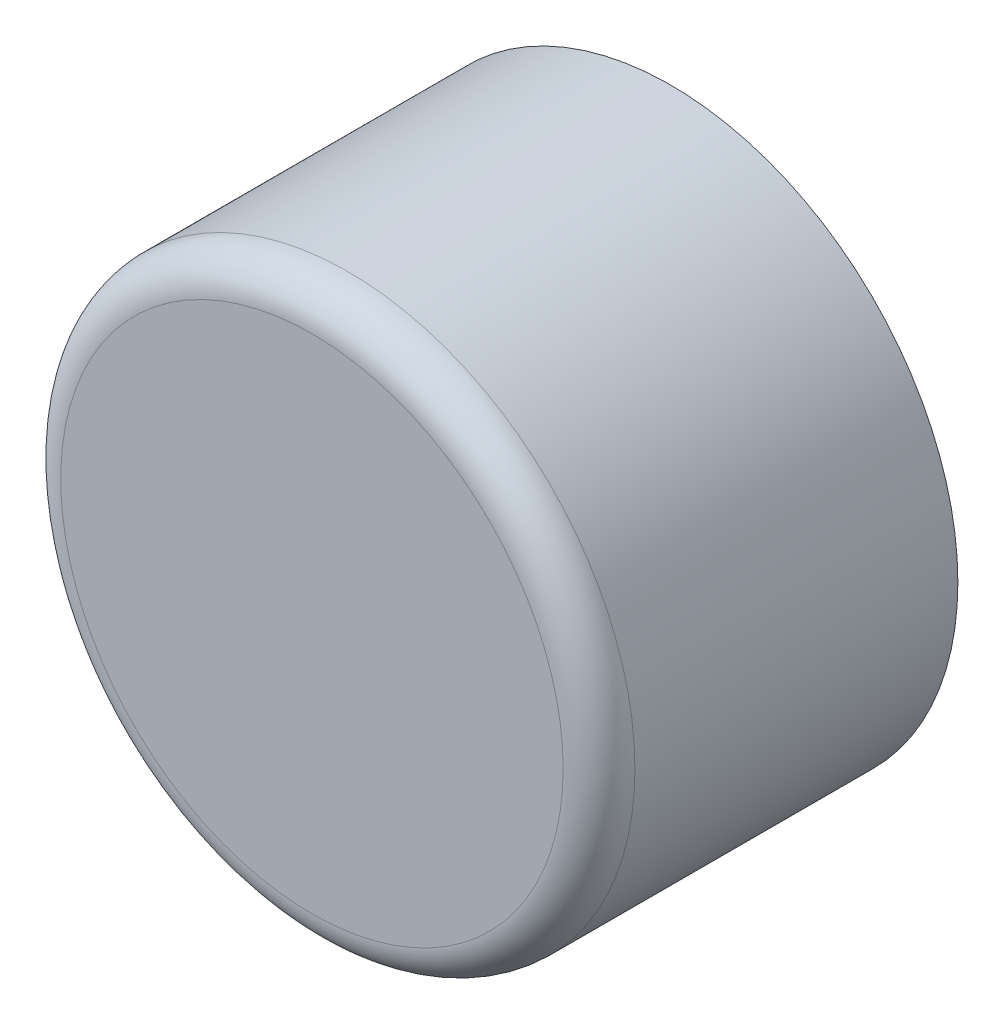
ISO-10303-21;
HEADER;
FILE_DESCRIPTION(('STEP AP214'),'2;1');
FILE_NAME('part.step','',(''),(''),'','','');
FILE_SCHEMA(('AUTOMOTIVE_DESIGN { 1 0 10303 214 1 1 1 1 }'));
ENDSEC;
DATA;
#1=APPLICATION_CONTEXT('core data for automotive mechanical design processes');
#2=APPLICATION_PROTOCOL_DEFINITION('international standard','automotive_design',2000,#1);
#3=PRODUCT_CONTEXT('',#1,'mechanical');
#4=PRODUCT('Part','Part','',(#3));
#5=PRODUCT_RELATED_PRODUCT_CATEGORY('part','',(#4));
#6=PRODUCT_DEFINITION_FORMATION('','',#4);
#7=PRODUCT_DEFINITION_CONTEXT('part definition',#1,'design');
#8=PRODUCT_DEFINITION('design','',#6,#7);
#9=PRODUCT_DEFINITION_SHAPE('','',#8);
#10=(LENGTH_UNIT() NAMED_UNIT(*) SI_UNIT(.MILLI.,.METRE.));
#11=(NAMED_UNIT(*) PLANE_ANGLE_UNIT() SI_UNIT($,.RADIAN.));
#12=(NAMED_UNIT(*) SI_UNIT($,.STERADIAN.) SOLID_ANGLE_UNIT());
#13=UNCERTAINTY_MEASURE_WITH_UNIT(LENGTH_MEASURE(1.E-05),#10,'distance_accuracy_value','');
#14=(GEOMETRIC_REPRESENTATION_CONTEXT(3) GLOBAL_UNCERTAINTY_ASSIGNED_CONTEXT((#13)) GLOBAL_UNIT_ASSIGNED_CONTEXT((#10,
#11,#12)) REPRESENTATION_CONTEXT('',''));
#15=CARTESIAN_POINT('',(0.,0.,0.));
#16=DIRECTION('',(0.,0.,1.));
#17=DIRECTION('',(1.,0.,0.));
#18=AXIS2_PLACEMENT_3D('',#15,#16,#17);
#19=CARTESIAN_POINT('',(0.,0.,100.));
#20=DIRECTION('',(0.,0.,-1.));
#21=DIRECTION('',(-1.,0.,0.));
#22=AXIS2_PLACEMENT_3D('',#19,#20,#21);
#23=CYLINDRICAL_SURFACE('',#22,80.);
#24=CARTESIAN_POINT('',(0.,0.,90.));
#25=DIRECTION('',(0.,0.,1.));
#26=DIRECTION('',(1.,0.,0.));
#27=AXIS2_PLACEMENT_3D('',#24,#25,#26);
#28=CIRCLE('',#27,80.);
#29=CARTESIAN_POINT('',(80.,0.,90.));
#30=VERTEX_POINT('',#29);
#31=EDGE_CURVE('E10',#30,#30,#28,.F.);
#32=ORIENTED_EDGE('',*,*,#31,.T.);
#33=EDGE_LOOP('',(#32));
#34=FACE_BOUND('',#33,.T.);
#35=CARTESIAN_POINT('',(0.,0.,0.));
#36=DIRECTION('',(0.,0.,1.));
#37=DIRECTION('',(1.,0.,0.));
#38=AXIS2_PLACEMENT_3D('',#35,#36,#37);
#39=CIRCLE('',#38,80.);
#40=CARTESIAN_POINT('',(80.,0.,0.));
#41=VERTEX_POINT('',#40);
#42=EDGE_CURVE('E50',#41,#41,#39,.T.);
#43=ORIENTED_EDGE('',*,*,#42,.T.);
#44=EDGE_LOOP('',(#43));
#45=FACE_BOUND('',#44,.T.);
#46=ADVANCED_FACE('F37',(#34,#45),#23,.T.);
#47=CARTESIAN_POINT('',(0.,0.,100.));
#48=DIRECTION('',(0.,0.,1.));
#49=DIRECTION('',(1.,0.,0.));
#50=AXIS2_PLACEMENT_3D('',#47,#48,#49);
#51=PLANE('',#50);
#52=CARTESIAN_POINT('',(0.,0.,100.));
#53=DIRECTION('',(0.,0.,1.));
#54=DIRECTION('',(1.,0.,0.));
#55=AXIS2_PLACEMENT_3D('',#52,#53,#54);
#56=CIRCLE('',#55,70.);
#57=CARTESIAN_POINT('',(70.,0.,100.));
#58=VERTEX_POINT('',#57);
#59=EDGE_CURVE('E45',#58,#58,#56,.T.);
#60=ORIENTED_EDGE('',*,*,#59,.T.);
#61=EDGE_LOOP('',(#60));
#62=FACE_BOUND('',#61,.T.);
#63=ADVANCED_FACE('F61',(#62),#51,.T.);
#64=CARTESIAN_POINT('',(0.,0.,0.));
#65=DIRECTION('',(0.,0.,1.));
#66=DIRECTION('',(1.,0.,0.));
#67=AXIS2_PLACEMENT_3D('',#64,#65,#66);
#68=PLANE('',#67);
#69=ORIENTED_EDGE('',*,*,#42,.F.);
#70=EDGE_LOOP('',(#69));
#71=FACE_BOUND('',#70,.T.);
#72=ADVANCED_FACE('F59',(#71),#68,.F.);
#73=CARTESIAN_POINT('',(0.,0.,90.));
#74=DIRECTION('',(0.,0.,1.));
#75=DIRECTION('',(1.,0.,0.));
#76=AXIS2_PLACEMENT_3D('',#73,#74,#75);
#77=TOROIDAL_SURFACE('',#76,70.,10.);
#78=ORIENTED_EDGE('',*,*,#31,.F.);
#79=EDGE_LOOP('',(#78));
#80=FACE_BOUND('',#79,.T.);
#81=ORIENTED_EDGE('',*,*,#59,.F.);
#82=EDGE_LOOP('',(#81));
#83=FACE_BOUND('',#82,.T.);
#84=ADVANCED_FACE('F39',(#80,#83),#77,.T.);
#85=CLOSED_SHELL('',(#46,#63,#72,#84));
#86=MANIFOLD_SOLID_BREP('B2',#85);
#87=ADVANCED_BREP_SHAPE_REPRESENTATION('',(#18,#86),#14);
#88=SHAPE_DEFINITION_REPRESENTATION(#9,#87);
ENDSEC;
END-ISO-10303-21;
